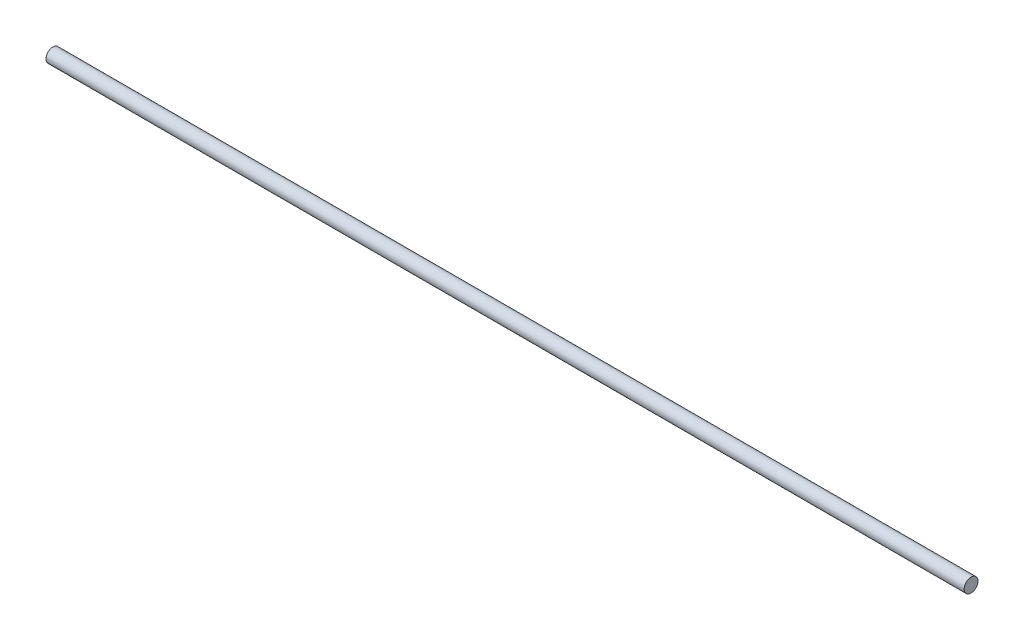
ISO-10303-21;
HEADER;
FILE_DESCRIPTION(('STEP AP214'),'2;1');
FILE_NAME('part.step','',(''),(''),'','','');
FILE_SCHEMA(('AUTOMOTIVE_DESIGN { 1 0 10303 214 1 1 1 1 }'));
ENDSEC;
DATA;
#1=APPLICATION_CONTEXT('core data for automotive mechanical design processes');
#2=APPLICATION_PROTOCOL_DEFINITION('international standard','automotive_design',2000,#1);
#3=PRODUCT_CONTEXT('',#1,'mechanical');
#4=PRODUCT('Part','Part','',(#3));
#5=PRODUCT_RELATED_PRODUCT_CATEGORY('part','',(#4));
#6=PRODUCT_DEFINITION_FORMATION('','',#4);
#7=PRODUCT_DEFINITION_CONTEXT('part definition',#1,'design');
#8=PRODUCT_DEFINITION('design','',#6,#7);
#9=PRODUCT_DEFINITION_SHAPE('','',#8);
#10=(LENGTH_UNIT() NAMED_UNIT(*) SI_UNIT(.MILLI.,.METRE.));
#11=(NAMED_UNIT(*) PLANE_ANGLE_UNIT() SI_UNIT($,.RADIAN.));
#12=(NAMED_UNIT(*) SI_UNIT($,.STERADIAN.) SOLID_ANGLE_UNIT());
#13=UNCERTAINTY_MEASURE_WITH_UNIT(LENGTH_MEASURE(1.E-05),#10,'distance_accuracy_value','');
#14=(GEOMETRIC_REPRESENTATION_CONTEXT(3) GLOBAL_UNCERTAINTY_ASSIGNED_CONTEXT((#13)) GLOBAL_UNIT_ASSIGNED_CONTEXT((#10,
#11,#12)) REPRESENTATION_CONTEXT('',''));
#15=CARTESIAN_POINT('',(0.,0.,0.));
#16=DIRECTION('',(0.,0.,1.));
#17=DIRECTION('',(1.,0.,0.));
#18=AXIS2_PLACEMENT_3D('',#15,#16,#17);
#19=CARTESIAN_POINT('',(264.14833164736,2.46968441183526,-1.11761469901239));
#20=DIRECTION('',(-1.,0.,0.));
#21=DIRECTION('',(0.,0.,1.));
#22=AXIS2_PLACEMENT_3D('',#19,#20,#21);
#23=CYLINDRICAL_SURFACE('',#22,4.);
#24=CARTESIAN_POINT('',(264.14833164736,2.46968441183526,-1.11761469901239));
#25=DIRECTION('',(1.,0.,0.));
#26=DIRECTION('',(0.,0.,-1.));
#27=AXIS2_PLACEMENT_3D('',#24,#25,#26);
#28=CIRCLE('',#27,4.);
#29=CARTESIAN_POINT('',(264.14833164736,2.46968441183526,-5.11761469901239));
#30=VERTEX_POINT('',#29);
#31=EDGE_CURVE('E9',#30,#30,#28,.T.);
#32=ORIENTED_EDGE('',*,*,#31,.F.);
#33=EDGE_LOOP('',(#32));
#34=FACE_BOUND('',#33,.T.);
#35=CARTESIAN_POINT('',(-266.85166835264,2.46968441183526,-1.11761469901239));
#36=DIRECTION('',(1.,0.,0.));
#37=DIRECTION('',(0.,0.,-1.));
#38=AXIS2_PLACEMENT_3D('',#35,#36,#37);
#39=CIRCLE('',#38,4.);
#40=CARTESIAN_POINT('',(-266.85166835264,2.46968441183526,-5.11761469901239));
#41=VERTEX_POINT('',#40);
#42=EDGE_CURVE('E17',#41,#41,#39,.T.);
#43=ORIENTED_EDGE('',*,*,#42,.T.);
#44=EDGE_LOOP('',(#43));
#45=FACE_BOUND('',#44,.T.);
#46=ADVANCED_FACE('F14',(#34,#45),#23,.T.);
#47=CARTESIAN_POINT('',(264.14833164736,2.46968441183526,-1.11761469901239));
#48=DIRECTION('',(1.,0.,0.));
#49=DIRECTION('',(0.,0.,-1.));
#50=AXIS2_PLACEMENT_3D('',#47,#48,#49);
#51=PLANE('',#50);
#52=ORIENTED_EDGE('',*,*,#31,.T.);
#53=EDGE_LOOP('',(#52));
#54=FACE_BOUND('',#53,.T.);
#55=ADVANCED_FACE('F29',(#54),#51,.T.);
#56=CARTESIAN_POINT('',(-266.85166835264,2.46968441183526,-1.11761469901239));
#57=DIRECTION('',(1.,0.,0.));
#58=DIRECTION('',(0.,0.,-1.));
#59=AXIS2_PLACEMENT_3D('',#56,#57,#58);
#60=PLANE('',#59);
#61=ORIENTED_EDGE('',*,*,#42,.F.);
#62=EDGE_LOOP('',(#61));
#63=FACE_BOUND('',#62,.T.);
#64=ADVANCED_FACE('F27',(#63),#60,.F.);
#65=CLOSED_SHELL('',(#46,#55,#64));
#66=MANIFOLD_SOLID_BREP('B1',#65);
#67=ADVANCED_BREP_SHAPE_REPRESENTATION('',(#18,#66),#14);
#68=SHAPE_DEFINITION_REPRESENTATION(#9,#67);
ENDSEC;
END-ISO-10303-21;
